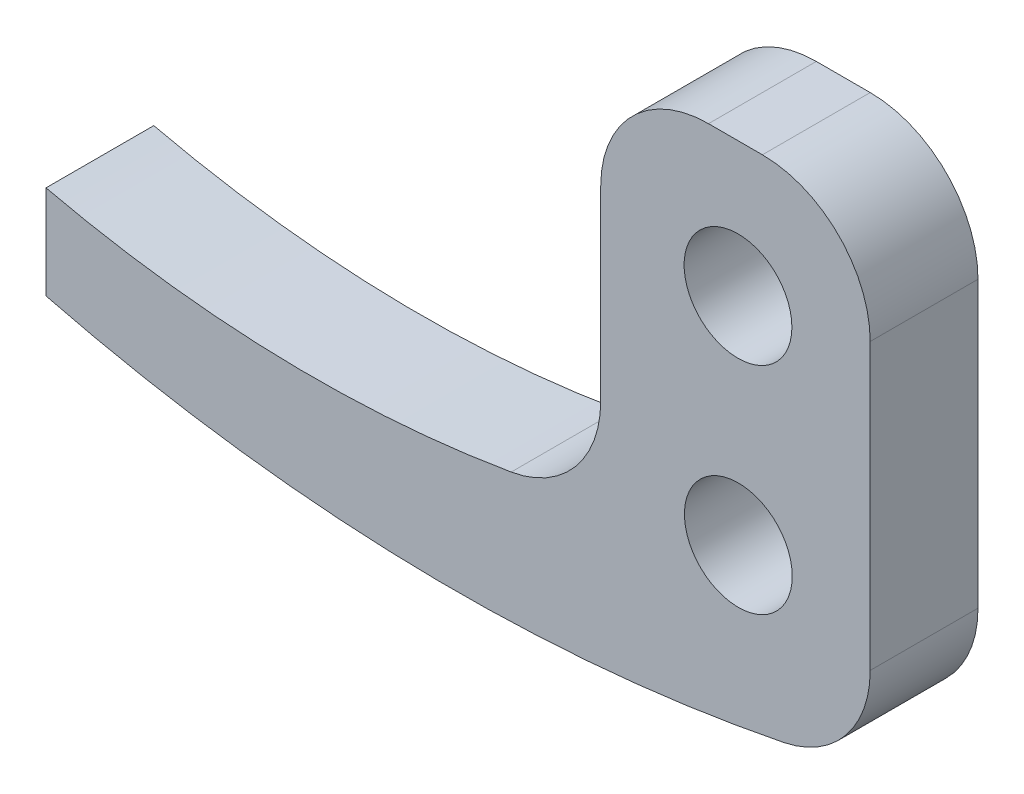
ISO-10303-21;
HEADER;
FILE_DESCRIPTION(('STEP AP214'),'2;1');
FILE_NAME('part.step','',(''),(''),'','','');
FILE_SCHEMA(('AUTOMOTIVE_DESIGN { 1 0 10303 214 1 1 1 1 }'));
ENDSEC;
DATA;
#1=APPLICATION_CONTEXT('core data for automotive mechanical design processes');
#2=APPLICATION_PROTOCOL_DEFINITION('international standard','automotive_design',2000,#1);
#3=PRODUCT_CONTEXT('',#1,'mechanical');
#4=PRODUCT('Part','Part','',(#3));
#5=PRODUCT_RELATED_PRODUCT_CATEGORY('part','',(#4));
#6=PRODUCT_DEFINITION_FORMATION('','',#4);
#7=PRODUCT_DEFINITION_CONTEXT('part definition',#1,'design');
#8=PRODUCT_DEFINITION('design','',#6,#7);
#9=PRODUCT_DEFINITION_SHAPE('','',#8);
#10=(LENGTH_UNIT() NAMED_UNIT(*) SI_UNIT(.MILLI.,.METRE.));
#11=(NAMED_UNIT(*) PLANE_ANGLE_UNIT() SI_UNIT($,.RADIAN.));
#12=(NAMED_UNIT(*) SI_UNIT($,.STERADIAN.) SOLID_ANGLE_UNIT());
#13=UNCERTAINTY_MEASURE_WITH_UNIT(LENGTH_MEASURE(1.E-05),#10,'distance_accuracy_value','');
#14=(GEOMETRIC_REPRESENTATION_CONTEXT(3) GLOBAL_UNCERTAINTY_ASSIGNED_CONTEXT((#13)) GLOBAL_UNIT_ASSIGNED_CONTEXT((#10,
#11,#12)) REPRESENTATION_CONTEXT('',''));
#15=CARTESIAN_POINT('',(0.,0.,0.));
#16=DIRECTION('',(0.,0.,1.));
#17=DIRECTION('',(1.,0.,0.));
#18=AXIS2_PLACEMENT_3D('',#15,#16,#17);
#19=CARTESIAN_POINT('',(3.75184441128013,36.0434288387833,2.));
#20=DIRECTION('',(0.,0.,1.));
#21=DIRECTION('',(1.,0.,0.));
#22=AXIS2_PLACEMENT_3D('',#19,#20,#21);
#23=PLANE('',#22);
#24=CARTESIAN_POINT('',(9.02322007688238,8.37625399850443,2.));
#25=DIRECTION('',(0.,0.,1.));
#26=DIRECTION('',(1.,0.,0.));
#27=AXIS2_PLACEMENT_3D('',#24,#25,#26);
#28=CIRCLE('',#27,1.);
#29=CARTESIAN_POINT('',(10.0232200768824,8.37625399850443,2.));
#30=VERTEX_POINT('',#29);
#31=EDGE_CURVE('E144',#30,#30,#28,.T.);
#32=ORIENTED_EDGE('',*,*,#31,.F.);
#33=EDGE_LOOP('',(#32));
#34=FACE_BOUND('',#33,.T.);
#35=CARTESIAN_POINT('',(3.75184441128013,36.0434288387833,2.));
#36=DIRECTION('',(0.,0.,1.));
#37=DIRECTION('',(1.,0.,0.));
#38=AXIS2_PLACEMENT_3D('',#35,#36,#37);
#39=CIRCLE('',#38,31.0251422770555);
#40=CARTESIAN_POINT('',(-3.82316337945185,5.95724080703217,2.));
#41=VERTEX_POINT('',#40);
#42=CARTESIAN_POINT('',(9.86383401893724,5.62627847344785,2.));
#43=VERTEX_POINT('',#42);
#44=EDGE_CURVE('E154',#41,#43,#39,.T.);
#45=ORIENTED_EDGE('',*,*,#44,.T.);
#46=CARTESIAN_POINT('',(9.46983166090924,7.58708497636148,2.));
#47=DIRECTION('',(0.,0.,1.));
#48=DIRECTION('',(1.,0.,0.));
#49=AXIS2_PLACEMENT_3D('',#46,#47,#48);
#50=CIRCLE('',#49,2.);
#51=CARTESIAN_POINT('',(11.4698316609092,7.58708497636148,2.));
#52=VERTEX_POINT('',#51);
#53=EDGE_CURVE('E178',#43,#52,#50,.T.);
#54=ORIENTED_EDGE('',*,*,#53,.T.);
#55=DIRECTION('',(0.,1.,0.));
#56=VECTOR('',#55,1.);
#57=CARTESIAN_POINT('',(11.4698316609092,9.74312733669852,2.));
#58=LINE('',#57,#56);
#59=CARTESIAN_POINT('',(11.4698316609092,12.8726221985353,2.));
#60=VERTEX_POINT('',#59);
#61=EDGE_CURVE('E242',#52,#60,#58,.T.);
#62=ORIENTED_EDGE('',*,*,#61,.T.);
#63=CARTESIAN_POINT('',(9.46983166090924,12.8726221985353,2.));
#64=DIRECTION('',(0.,0.,1.));
#65=DIRECTION('',(1.,0.,0.));
#66=AXIS2_PLACEMENT_3D('',#63,#64,#65);
#67=CIRCLE('',#66,2.);
#68=CARTESIAN_POINT('',(9.46983166090924,14.8726221985353,2.));
#69=VERTEX_POINT('',#68);
#70=EDGE_CURVE('E55',#60,#69,#67,.T.);
#71=ORIENTED_EDGE('',*,*,#70,.T.);
#72=DIRECTION('',(-1.,0.,0.));
#73=VECTOR('',#72,1.);
#74=CARTESIAN_POINT('',(6.46983166090924,14.8726221985353,2.));
#75=LINE('',#74,#73);
#76=CARTESIAN_POINT('',(8.46983166090924,14.8726221985353,2.));
#77=VERTEX_POINT('',#76);
#78=EDGE_CURVE('E244',#69,#77,#75,.T.);
#79=ORIENTED_EDGE('',*,*,#78,.T.);
#80=CARTESIAN_POINT('',(8.46983166090924,12.8726221985353,2.));
#81=DIRECTION('',(0.,0.,1.));
#82=DIRECTION('',(1.,0.,0.));
#83=AXIS2_PLACEMENT_3D('',#80,#81,#82);
#84=CIRCLE('',#83,2.);
#85=CARTESIAN_POINT('',(6.46983166090924,12.8726221985353,2.));
#86=VERTEX_POINT('',#85);
#87=EDGE_CURVE('E176',#77,#86,#84,.T.);
#88=ORIENTED_EDGE('',*,*,#87,.T.);
#89=DIRECTION('',(0.,-1.,0.));
#90=VECTOR('',#89,1.);
#91=CARTESIAN_POINT('',(6.46983166090924,7.79651918801508,2.));
#92=LINE('',#91,#90);
#93=CARTESIAN_POINT('',(6.46983166090924,9.41514359210574,2.));
#94=VERTEX_POINT('',#93);
#95=EDGE_CURVE('E121',#86,#94,#92,.T.);
#96=ORIENTED_EDGE('',*,*,#95,.T.);
#97=CARTESIAN_POINT('',(4.46983166090924,9.41514359210574,2.));
#98=DIRECTION('',(0.,0.,1.));
#99=DIRECTION('',(1.,0.,0.));
#100=AXIS2_PLACEMENT_3D('',#97,#98,#99);
#101=CIRCLE('',#100,2.);
#102=CARTESIAN_POINT('',(4.80848499851992,7.44402362697802,2.));
#103=VERTEX_POINT('',#102);
#104=EDGE_CURVE('E11',#94,#103,#101,.F.);
#105=ORIENTED_EDGE('',*,*,#104,.T.);
#106=CARTESIAN_POINT('',(1.11386633381551,28.9484229779879,2.));
#107=DIRECTION('',(0.,0.,-1.));
#108=DIRECTION('',(1.,0.,0.));
#109=AXIS2_PLACEMENT_3D('',#106,#107,#108);
#110=CIRCLE('',#109,21.8194729204281);
#111=CARTESIAN_POINT('',(-3.82316337945185,7.69483184294412,2.));
#112=VERTEX_POINT('',#111);
#113=EDGE_CURVE('E109',#103,#112,#110,.T.);
#114=ORIENTED_EDGE('',*,*,#113,.T.);
#115=DIRECTION('',(0.,-1.,0.));
#116=VECTOR('',#115,1.);
#117=CARTESIAN_POINT('',(-3.82316337945185,5.95724080703217,2.));
#118=LINE('',#117,#116);
#119=EDGE_CURVE('E114',#112,#41,#118,.T.);
#120=ORIENTED_EDGE('',*,*,#119,.T.);
#121=EDGE_LOOP('',(#45,#54,#62,#71,#79,#88,#96,#105,#114,#120));
#122=FACE_BOUND('',#121,.T.);
#123=CARTESIAN_POINT('',(9.01670216678874,12.3762486881069,2.));
#124=DIRECTION('',(0.,0.,1.));
#125=DIRECTION('',(1.,0.,0.));
#126=AXIS2_PLACEMENT_3D('',#123,#124,#125);
#127=CIRCLE('',#126,1.00000000000001);
#128=CARTESIAN_POINT('',(10.0167021667887,12.3762486881069,2.));
#129=VERTEX_POINT('',#128);
#130=EDGE_CURVE('E336',#129,#129,#127,.T.);
#131=ORIENTED_EDGE('',*,*,#130,.F.);
#132=EDGE_LOOP('',(#131));
#133=FACE_BOUND('',#132,.T.);
#134=ADVANCED_FACE('F33',(#34,#122,#133),#23,.T.);
#135=CARTESIAN_POINT('',(3.75184441128013,36.0434288387833,0.));
#136=DIRECTION('',(0.,0.,1.));
#137=DIRECTION('',(1.,0.,0.));
#138=AXIS2_PLACEMENT_3D('',#135,#136,#137);
#139=PLANE('',#138);
#140=DIRECTION('',(0.,1.,0.));
#141=VECTOR('',#140,1.);
#142=CARTESIAN_POINT('',(11.4698316609092,14.8726221985353,0.));
#143=LINE('',#142,#141);
#144=CARTESIAN_POINT('',(11.4698316609092,7.58708497636148,0.));
#145=VERTEX_POINT('',#144);
#146=CARTESIAN_POINT('',(11.4698316609092,12.8726221985353,0.));
#147=VERTEX_POINT('',#146);
#148=EDGE_CURVE('E143',#145,#147,#143,.T.);
#149=ORIENTED_EDGE('',*,*,#148,.F.);
#150=CARTESIAN_POINT('',(9.46983166090924,7.58708497636148,0.));
#151=DIRECTION('',(0.,0.,1.));
#152=DIRECTION('',(1.,0.,0.));
#153=AXIS2_PLACEMENT_3D('',#150,#151,#152);
#154=CIRCLE('',#153,2.);
#155=CARTESIAN_POINT('',(9.86383401893724,5.62627847344785,0.));
#156=VERTEX_POINT('',#155);
#157=EDGE_CURVE('E171',#145,#156,#154,.F.);
#158=ORIENTED_EDGE('',*,*,#157,.T.);
#159=CARTESIAN_POINT('',(3.75184441128013,36.0434288387833,0.));
#160=DIRECTION('',(0.,0.,1.));
#161=DIRECTION('',(1.,0.,0.));
#162=AXIS2_PLACEMENT_3D('',#159,#160,#161);
#163=CIRCLE('',#162,31.0251422770555);
#164=CARTESIAN_POINT('',(-3.82316337945185,5.95724080703217,0.));
#165=VERTEX_POINT('',#164);
#166=EDGE_CURVE('E140',#165,#156,#163,.T.);
#167=ORIENTED_EDGE('',*,*,#166,.F.);
#168=DIRECTION('',(0.,-1.,0.));
#169=VECTOR('',#168,1.);
#170=CARTESIAN_POINT('',(-3.82316337945185,5.95724080703217,0.));
#171=LINE('',#170,#169);
#172=CARTESIAN_POINT('',(-3.82316337945185,7.69483184294412,0.));
#173=VERTEX_POINT('',#172);
#174=EDGE_CURVE('E153',#173,#165,#171,.T.);
#175=ORIENTED_EDGE('',*,*,#174,.F.);
#176=CARTESIAN_POINT('',(1.11386633381551,28.9484229779879,0.));
#177=DIRECTION('',(0.,0.,-1.));
#178=DIRECTION('',(1.,0.,0.));
#179=AXIS2_PLACEMENT_3D('',#176,#177,#178);
#180=CIRCLE('',#179,21.8194729204281);
#181=CARTESIAN_POINT('',(4.80848499851992,7.44402362697802,0.));
#182=VERTEX_POINT('',#181);
#183=EDGE_CURVE('E127',#182,#173,#180,.T.);
#184=ORIENTED_EDGE('',*,*,#183,.F.);
#185=CARTESIAN_POINT('',(4.46983166090924,9.41514359210574,0.));
#186=DIRECTION('',(0.,0.,1.));
#187=DIRECTION('',(1.,0.,0.));
#188=AXIS2_PLACEMENT_3D('',#185,#186,#187);
#189=CIRCLE('',#188,2.);
#190=CARTESIAN_POINT('',(6.46983166090924,9.41514359210574,0.));
#191=VERTEX_POINT('',#190);
#192=EDGE_CURVE('E41',#182,#191,#189,.T.);
#193=ORIENTED_EDGE('',*,*,#192,.T.);
#194=DIRECTION('',(0.,-1.,0.));
#195=VECTOR('',#194,1.);
#196=CARTESIAN_POINT('',(6.46983166090924,7.79651918801508,0.));
#197=LINE('',#196,#195);
#198=CARTESIAN_POINT('',(6.46983166090924,12.8726221985353,0.));
#199=VERTEX_POINT('',#198);
#200=EDGE_CURVE('E149',#199,#191,#197,.T.);
#201=ORIENTED_EDGE('',*,*,#200,.F.);
#202=CARTESIAN_POINT('',(8.46983166090924,12.8726221985353,0.));
#203=DIRECTION('',(0.,0.,1.));
#204=DIRECTION('',(1.,0.,0.));
#205=AXIS2_PLACEMENT_3D('',#202,#203,#204);
#206=CIRCLE('',#205,2.);
#207=CARTESIAN_POINT('',(8.46983166090924,14.8726221985353,0.));
#208=VERTEX_POINT('',#207);
#209=EDGE_CURVE('E169',#199,#208,#206,.F.);
#210=ORIENTED_EDGE('',*,*,#209,.T.);
#211=DIRECTION('',(-1.,0.,0.));
#212=VECTOR('',#211,1.);
#213=CARTESIAN_POINT('',(6.46983166090924,14.8726221985353,0.));
#214=LINE('',#213,#212);
#215=CARTESIAN_POINT('',(9.46983166090924,14.8726221985353,0.));
#216=VERTEX_POINT('',#215);
#217=EDGE_CURVE('E147',#216,#208,#214,.T.);
#218=ORIENTED_EDGE('',*,*,#217,.F.);
#219=CARTESIAN_POINT('',(9.46983166090924,12.8726221985353,0.));
#220=DIRECTION('',(0.,0.,1.));
#221=DIRECTION('',(1.,0.,0.));
#222=AXIS2_PLACEMENT_3D('',#219,#220,#221);
#223=CIRCLE('',#222,2.);
#224=EDGE_CURVE('E167',#216,#147,#223,.F.);
#225=ORIENTED_EDGE('',*,*,#224,.T.);
#226=EDGE_LOOP('',(#149,#158,#167,#175,#184,#193,#201,#210,#218,#225));
#227=FACE_BOUND('',#226,.T.);
#228=CARTESIAN_POINT('',(9.02322007688238,8.37625399850443,0.));
#229=DIRECTION('',(0.,0.,1.));
#230=DIRECTION('',(1.,0.,0.));
#231=AXIS2_PLACEMENT_3D('',#228,#229,#230);
#232=CIRCLE('',#231,1.);
#233=CARTESIAN_POINT('',(10.0232200768824,8.37625399850443,0.));
#234=VERTEX_POINT('',#233);
#235=EDGE_CURVE('E335',#234,#234,#232,.T.);
#236=ORIENTED_EDGE('',*,*,#235,.T.);
#237=EDGE_LOOP('',(#236));
#238=FACE_BOUND('',#237,.T.);
#239=CARTESIAN_POINT('',(9.01670216678874,12.3762486881069,0.));
#240=DIRECTION('',(0.,0.,1.));
#241=DIRECTION('',(1.,0.,0.));
#242=AXIS2_PLACEMENT_3D('',#239,#240,#241);
#243=CIRCLE('',#242,1.00000000000001);
#244=CARTESIAN_POINT('',(10.0167021667887,12.3762486881069,0.));
#245=VERTEX_POINT('',#244);
#246=EDGE_CURVE('E339',#245,#245,#243,.T.);
#247=ORIENTED_EDGE('',*,*,#246,.T.);
#248=EDGE_LOOP('',(#247));
#249=FACE_BOUND('',#248,.T.);
#250=ADVANCED_FACE('F186',(#227,#238,#249),#139,.F.);
#251=CARTESIAN_POINT('',(3.75184441128013,36.0434288387833,2.));
#252=DIRECTION('',(0.,0.,-1.));
#253=DIRECTION('',(-1.,0.,0.));
#254=AXIS2_PLACEMENT_3D('',#251,#252,#253);
#255=CYLINDRICAL_SURFACE('',#254,31.0251422770555);
#256=ORIENTED_EDGE('',*,*,#166,.T.);
#257=DIRECTION('',(0.,0.,-1.));
#258=VECTOR('',#257,1.);
#259=CARTESIAN_POINT('',(9.86383401893724,5.62627847344784,2.));
#260=LINE('',#259,#258);
#261=EDGE_CURVE('E173',#156,#43,#260,.F.);
#262=ORIENTED_EDGE('',*,*,#261,.T.);
#263=ORIENTED_EDGE('',*,*,#44,.F.);
#264=DIRECTION('',(0.,0.,-1.));
#265=VECTOR('',#264,1.);
#266=CARTESIAN_POINT('',(-3.82316337945185,5.95724080703217,2.));
#267=LINE('',#266,#265);
#268=EDGE_CURVE('E131',#41,#165,#267,.T.);
#269=ORIENTED_EDGE('',*,*,#268,.T.);
#270=EDGE_LOOP('',(#256,#262,#263,#269));
#271=FACE_BOUND('',#270,.T.);
#272=ADVANCED_FACE('F216',(#271),#255,.T.);
#273=CARTESIAN_POINT('',(11.4698316609092,14.8726221985353,2.));
#274=DIRECTION('',(-1.,0.,0.));
#275=DIRECTION('',(0.,0.,1.));
#276=AXIS2_PLACEMENT_3D('',#273,#274,#275);
#277=PLANE('',#276);
#278=ORIENTED_EDGE('',*,*,#61,.F.);
#279=DIRECTION('',(0.,0.,-1.));
#280=VECTOR('',#279,1.);
#281=CARTESIAN_POINT('',(11.4698316609092,7.58708497636148,2.));
#282=LINE('',#281,#280);
#283=EDGE_CURVE('E164',#52,#145,#282,.T.);
#284=ORIENTED_EDGE('',*,*,#283,.T.);
#285=ORIENTED_EDGE('',*,*,#148,.T.);
#286=DIRECTION('',(0.,0.,-1.));
#287=VECTOR('',#286,1.);
#288=CARTESIAN_POINT('',(11.4698316609092,12.8726221985353,2.));
#289=LINE('',#288,#287);
#290=EDGE_CURVE('E162',#147,#60,#289,.F.);
#291=ORIENTED_EDGE('',*,*,#290,.T.);
#292=EDGE_LOOP('',(#278,#284,#285,#291));
#293=FACE_BOUND('',#292,.T.);
#294=ADVANCED_FACE('F230',(#293),#277,.F.);
#295=CARTESIAN_POINT('',(6.46983166090924,14.8726221985353,2.));
#296=DIRECTION('',(0.,-1.,0.));
#297=DIRECTION('',(0.,0.,-1.));
#298=AXIS2_PLACEMENT_3D('',#295,#296,#297);
#299=PLANE('',#298);
#300=ORIENTED_EDGE('',*,*,#217,.T.);
#301=DIRECTION('',(0.,0.,-1.));
#302=VECTOR('',#301,1.);
#303=CARTESIAN_POINT('',(8.46983166090924,14.8726221985353,2.));
#304=LINE('',#303,#302);
#305=EDGE_CURVE('E48',#208,#77,#304,.F.);
#306=ORIENTED_EDGE('',*,*,#305,.T.);
#307=ORIENTED_EDGE('',*,*,#78,.F.);
#308=DIRECTION('',(0.,0.,-1.));
#309=VECTOR('',#308,1.);
#310=CARTESIAN_POINT('',(9.46983166090924,14.8726221985353,2.));
#311=LINE('',#310,#309);
#312=EDGE_CURVE('E180',#69,#216,#311,.T.);
#313=ORIENTED_EDGE('',*,*,#312,.T.);
#314=EDGE_LOOP('',(#300,#306,#307,#313));
#315=FACE_BOUND('',#314,.T.);
#316=ADVANCED_FACE('F227',(#315),#299,.F.);
#317=CARTESIAN_POINT('',(6.46983166090924,7.79651918801508,2.));
#318=DIRECTION('',(1.,0.,0.));
#319=DIRECTION('',(0.,0.,-1.));
#320=AXIS2_PLACEMENT_3D('',#317,#318,#319);
#321=PLANE('',#320);
#322=ORIENTED_EDGE('',*,*,#200,.T.);
#323=DIRECTION('',(0.,0.,1.));
#324=VECTOR('',#323,1.);
#325=CARTESIAN_POINT('',(6.46983166090924,9.41514359210574,2.));
#326=LINE('',#325,#324);
#327=EDGE_CURVE('E160',#191,#94,#326,.T.);
#328=ORIENTED_EDGE('',*,*,#327,.T.);
#329=ORIENTED_EDGE('',*,*,#95,.F.);
#330=DIRECTION('',(0.,0.,-1.));
#331=VECTOR('',#330,1.);
#332=CARTESIAN_POINT('',(6.46983166090924,12.8726221985353,2.));
#333=LINE('',#332,#331);
#334=EDGE_CURVE('E157',#86,#199,#333,.T.);
#335=ORIENTED_EDGE('',*,*,#334,.T.);
#336=EDGE_LOOP('',(#322,#328,#329,#335));
#337=FACE_BOUND('',#336,.T.);
#338=ADVANCED_FACE('F191',(#337),#321,.F.);
#339=CARTESIAN_POINT('',(1.11386633381551,28.9484229779879,2.));
#340=DIRECTION('',(0.,0.,-1.));
#341=DIRECTION('',(-1.,0.,0.));
#342=AXIS2_PLACEMENT_3D('',#339,#340,#341);
#343=CYLINDRICAL_SURFACE('',#342,21.8194729204281);
#344=ORIENTED_EDGE('',*,*,#113,.F.);
#345=DIRECTION('',(0.,0.,-1.));
#346=VECTOR('',#345,1.);
#347=CARTESIAN_POINT('',(4.80848499851992,7.44402362697801,2.));
#348=LINE('',#347,#346);
#349=EDGE_CURVE('E130',#103,#182,#348,.T.);
#350=ORIENTED_EDGE('',*,*,#349,.T.);
#351=ORIENTED_EDGE('',*,*,#183,.T.);
#352=DIRECTION('',(0.,0.,-1.));
#353=VECTOR('',#352,1.);
#354=CARTESIAN_POINT('',(-3.82316337945185,7.69483184294412,2.));
#355=LINE('',#354,#353);
#356=EDGE_CURVE('E124',#112,#173,#355,.T.);
#357=ORIENTED_EDGE('',*,*,#356,.F.);
#358=EDGE_LOOP('',(#344,#350,#351,#357));
#359=FACE_BOUND('',#358,.T.);
#360=ADVANCED_FACE('F125',(#359),#343,.F.);
#361=CARTESIAN_POINT('',(-3.82316337945185,5.95724080703217,2.));
#362=DIRECTION('',(1.,0.,0.));
#363=DIRECTION('',(0.,0.,-1.));
#364=AXIS2_PLACEMENT_3D('',#361,#362,#363);
#365=PLANE('',#364);
#366=ORIENTED_EDGE('',*,*,#174,.T.);
#367=ORIENTED_EDGE('',*,*,#268,.F.);
#368=ORIENTED_EDGE('',*,*,#119,.F.);
#369=ORIENTED_EDGE('',*,*,#356,.T.);
#370=EDGE_LOOP('',(#366,#367,#368,#369));
#371=FACE_BOUND('',#370,.T.);
#372=ADVANCED_FACE('F133',(#371),#365,.F.);
#373=CARTESIAN_POINT('',(9.02322007688238,8.37625399850443,2.));
#374=DIRECTION('',(0.,0.,-1.));
#375=DIRECTION('',(-1.,0.,0.));
#376=AXIS2_PLACEMENT_3D('',#373,#374,#375);
#377=CYLINDRICAL_SURFACE('',#376,1.);
#378=ORIENTED_EDGE('',*,*,#31,.T.);
#379=EDGE_LOOP('',(#378));
#380=FACE_BOUND('',#379,.T.);
#381=ORIENTED_EDGE('',*,*,#235,.F.);
#382=EDGE_LOOP('',(#381));
#383=FACE_BOUND('',#382,.T.);
#384=ADVANCED_FACE('F206',(#380,#383),#377,.F.);
#385=CARTESIAN_POINT('',(9.01670216678874,12.3762486881069,2.));
#386=DIRECTION('',(0.,0.,-1.));
#387=DIRECTION('',(-1.,0.,0.));
#388=AXIS2_PLACEMENT_3D('',#385,#386,#387);
#389=CYLINDRICAL_SURFACE('',#388,1.00000000000001);
#390=ORIENTED_EDGE('',*,*,#130,.T.);
#391=EDGE_LOOP('',(#390));
#392=FACE_BOUND('',#391,.T.);
#393=ORIENTED_EDGE('',*,*,#246,.F.);
#394=EDGE_LOOP('',(#393));
#395=FACE_BOUND('',#394,.T.);
#396=ADVANCED_FACE('F197',(#392,#395),#389,.F.);
#397=CARTESIAN_POINT('',(4.46983166090924,9.41514359210574,2.));
#398=DIRECTION('',(0.,0.,-1.));
#399=DIRECTION('',(-1.,0.,0.));
#400=AXIS2_PLACEMENT_3D('',#397,#398,#399);
#401=CYLINDRICAL_SURFACE('',#400,2.);
#402=ORIENTED_EDGE('',*,*,#104,.F.);
#403=ORIENTED_EDGE('',*,*,#327,.F.);
#404=ORIENTED_EDGE('',*,*,#192,.F.);
#405=ORIENTED_EDGE('',*,*,#349,.F.);
#406=EDGE_LOOP('',(#402,#403,#404,#405));
#407=FACE_BOUND('',#406,.T.);
#408=ADVANCED_FACE('F194',(#407),#401,.F.);
#409=CARTESIAN_POINT('',(9.46983166090924,7.58708497636148,2.));
#410=DIRECTION('',(0.,0.,-1.));
#411=DIRECTION('',(-1.,0.,0.));
#412=AXIS2_PLACEMENT_3D('',#409,#410,#411);
#413=CYLINDRICAL_SURFACE('',#412,2.);
#414=ORIENTED_EDGE('',*,*,#53,.F.);
#415=ORIENTED_EDGE('',*,*,#261,.F.);
#416=ORIENTED_EDGE('',*,*,#157,.F.);
#417=ORIENTED_EDGE('',*,*,#283,.F.);
#418=EDGE_LOOP('',(#414,#415,#416,#417));
#419=FACE_BOUND('',#418,.T.);
#420=ADVANCED_FACE('F196',(#419),#413,.T.);
#421=CARTESIAN_POINT('',(8.46983166090924,12.8726221985353,2.));
#422=DIRECTION('',(0.,0.,-1.));
#423=DIRECTION('',(-1.,0.,0.));
#424=AXIS2_PLACEMENT_3D('',#421,#422,#423);
#425=CYLINDRICAL_SURFACE('',#424,2.);
#426=ORIENTED_EDGE('',*,*,#87,.F.);
#427=ORIENTED_EDGE('',*,*,#305,.F.);
#428=ORIENTED_EDGE('',*,*,#209,.F.);
#429=ORIENTED_EDGE('',*,*,#334,.F.);
#430=EDGE_LOOP('',(#426,#427,#428,#429));
#431=FACE_BOUND('',#430,.T.);
#432=ADVANCED_FACE('F203',(#431),#425,.T.);
#433=CARTESIAN_POINT('',(9.46983166090924,12.8726221985353,2.));
#434=DIRECTION('',(0.,0.,-1.));
#435=DIRECTION('',(-1.,0.,0.));
#436=AXIS2_PLACEMENT_3D('',#433,#434,#435);
#437=CYLINDRICAL_SURFACE('',#436,2.);
#438=ORIENTED_EDGE('',*,*,#70,.F.);
#439=ORIENTED_EDGE('',*,*,#290,.F.);
#440=ORIENTED_EDGE('',*,*,#224,.F.);
#441=ORIENTED_EDGE('',*,*,#312,.F.);
#442=EDGE_LOOP('',(#438,#439,#440,#441));
#443=FACE_BOUND('',#442,.T.);
#444=ADVANCED_FACE('F35',(#443),#437,.T.);
#445=CLOSED_SHELL('',(#134,#250,#272,#294,#316,#338,#360,#372,#384,#396,#408,#420,#432,#444));
#446=MANIFOLD_SOLID_BREP('B2',#445);
#447=ADVANCED_BREP_SHAPE_REPRESENTATION('',(#18,#446),#14);
#448=SHAPE_DEFINITION_REPRESENTATION(#9,#447);
ENDSEC;
END-ISO-10303-21;
